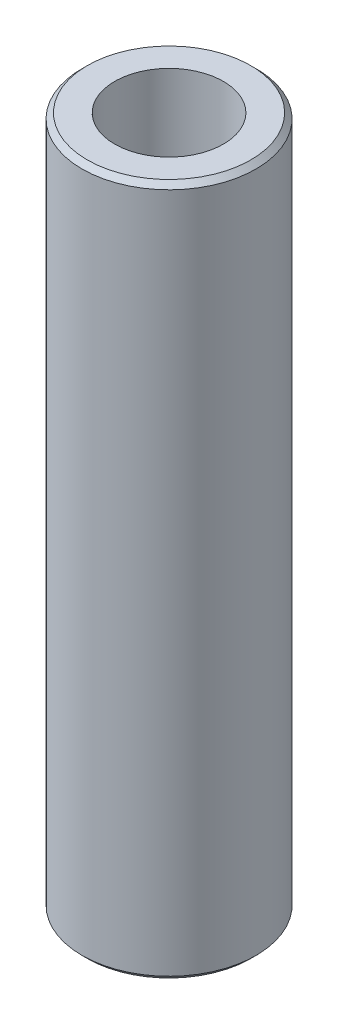
ISO-10303-21;
HEADER;
FILE_DESCRIPTION(('STEP AP214'),'2;1');
FILE_NAME('part.step','',(''),(''),'','','');
FILE_SCHEMA(('AUTOMOTIVE_DESIGN { 1 0 10303 214 1 1 1 1 }'));
ENDSEC;
DATA;
#1=APPLICATION_CONTEXT('core data for automotive mechanical design processes');
#2=APPLICATION_PROTOCOL_DEFINITION('international standard','automotive_design',2000,#1);
#3=PRODUCT_CONTEXT('',#1,'mechanical');
#4=PRODUCT('Part','Part','',(#3));
#5=PRODUCT_RELATED_PRODUCT_CATEGORY('part','',(#4));
#6=PRODUCT_DEFINITION_FORMATION('','',#4);
#7=PRODUCT_DEFINITION_CONTEXT('part definition',#1,'design');
#8=PRODUCT_DEFINITION('design','',#6,#7);
#9=PRODUCT_DEFINITION_SHAPE('','',#8);
#10=(LENGTH_UNIT() NAMED_UNIT(*) SI_UNIT(.MILLI.,.METRE.));
#11=(NAMED_UNIT(*) PLANE_ANGLE_UNIT() SI_UNIT($,.RADIAN.));
#12=(NAMED_UNIT(*) SI_UNIT($,.STERADIAN.) SOLID_ANGLE_UNIT());
#13=UNCERTAINTY_MEASURE_WITH_UNIT(LENGTH_MEASURE(1.E-05),#10,'distance_accuracy_value','');
#14=(GEOMETRIC_REPRESENTATION_CONTEXT(3) GLOBAL_UNCERTAINTY_ASSIGNED_CONTEXT((#13)) GLOBAL_UNIT_ASSIGNED_CONTEXT((#10,
#11,#12)) REPRESENTATION_CONTEXT('',''));
#15=CARTESIAN_POINT('',(0.,0.,0.));
#16=DIRECTION('',(0.,0.,1.));
#17=DIRECTION('',(1.,0.,0.));
#18=AXIS2_PLACEMENT_3D('',#15,#16,#17);
#19=CARTESIAN_POINT('',(0.,278.230469036696,0.));
#20=DIRECTION('',(0.,-1.,0.));
#21=DIRECTION('',(0.,0.,-1.));
#22=AXIS2_PLACEMENT_3D('',#19,#20,#21);
#23=CYLINDRICAL_SURFACE('',#22,35.);
#24=CARTESIAN_POINT('',(0.,276.122898551821,0.));
#25=DIRECTION('',(0.,1.,0.));
#26=DIRECTION('',(0.,0.,1.));
#27=AXIS2_PLACEMENT_3D('',#24,#25,#26);
#28=CIRCLE('',#27,35.);
#29=CARTESIAN_POINT('',(0.,276.122898551821,35.));
#30=VERTEX_POINT('',#29);
#31=EDGE_CURVE('E50',#30,#30,#28,.F.);
#32=ORIENTED_EDGE('',*,*,#31,.T.);
#33=EDGE_LOOP('',(#32));
#34=FACE_BOUND('',#33,.T.);
#35=CARTESIAN_POINT('',(0.,2.10757048487475,0.));
#36=DIRECTION('',(0.,1.,0.));
#37=DIRECTION('',(0.,0.,1.));
#38=AXIS2_PLACEMENT_3D('',#35,#36,#37);
#39=CIRCLE('',#38,35.);
#40=CARTESIAN_POINT('',(0.,2.10757048487475,35.));
#41=VERTEX_POINT('',#40);
#42=EDGE_CURVE('E51',#41,#41,#39,.T.);
#43=ORIENTED_EDGE('',*,*,#42,.T.);
#44=EDGE_LOOP('',(#43));
#45=FACE_BOUND('',#44,.T.);
#46=ADVANCED_FACE('F39',(#34,#45),#23,.T.);
#47=CARTESIAN_POINT('',(0.,278.230469036696,0.));
#48=DIRECTION('',(0.,1.,0.));
#49=DIRECTION('',(0.,0.,1.));
#50=AXIS2_PLACEMENT_3D('',#47,#48,#49);
#51=PLANE('',#50);
#52=CARTESIAN_POINT('',(0.,278.230469036696,0.));
#53=DIRECTION('',(0.,1.,0.));
#54=DIRECTION('',(0.,0.,1.));
#55=AXIS2_PLACEMENT_3D('',#52,#53,#54);
#56=CIRCLE('',#55,32.8924295151252);
#57=CARTESIAN_POINT('',(0.,278.230469036696,32.8924295151252));
#58=VERTEX_POINT('',#57);
#59=EDGE_CURVE('E54',#58,#58,#56,.T.);
#60=ORIENTED_EDGE('',*,*,#59,.T.);
#61=EDGE_LOOP('',(#60));
#62=FACE_BOUND('',#61,.T.);
#63=CARTESIAN_POINT('',(0.,278.230469036696,0.));
#64=DIRECTION('',(0.,1.,0.));
#65=DIRECTION('',(0.,0.,1.));
#66=AXIS2_PLACEMENT_3D('',#63,#64,#65);
#67=CIRCLE('',#66,21.8760022699073);
#68=CARTESIAN_POINT('',(0.,278.230469036696,21.8760022699073));
#69=VERTEX_POINT('',#68);
#70=EDGE_CURVE('E58',#69,#69,#67,.T.);
#71=ORIENTED_EDGE('',*,*,#70,.F.);
#72=EDGE_LOOP('',(#71));
#73=FACE_BOUND('',#72,.T.);
#74=ADVANCED_FACE('F69',(#62,#73),#51,.T.);
#75=CARTESIAN_POINT('',(0.,0.,0.));
#76=DIRECTION('',(0.,1.,0.));
#77=DIRECTION('',(0.,0.,1.));
#78=AXIS2_PLACEMENT_3D('',#75,#76,#77);
#79=PLANE('',#78);
#80=CARTESIAN_POINT('',(0.,0.,0.));
#81=DIRECTION('',(0.,1.,0.));
#82=DIRECTION('',(0.,0.,1.));
#83=AXIS2_PLACEMENT_3D('',#80,#81,#82);
#84=CIRCLE('',#83,32.8924295151252);
#85=CARTESIAN_POINT('',(0.,0.,32.8924295151252));
#86=VERTEX_POINT('',#85);
#87=EDGE_CURVE('E10',#86,#86,#84,.F.);
#88=ORIENTED_EDGE('',*,*,#87,.T.);
#89=EDGE_LOOP('',(#88));
#90=FACE_BOUND('',#89,.T.);
#91=CARTESIAN_POINT('',(0.,0.,0.));
#92=DIRECTION('',(0.,1.,0.));
#93=DIRECTION('',(0.,0.,1.));
#94=AXIS2_PLACEMENT_3D('',#91,#92,#93);
#95=CIRCLE('',#94,21.8760022699073);
#96=CARTESIAN_POINT('',(0.,0.,21.8760022699073));
#97=VERTEX_POINT('',#96);
#98=EDGE_CURVE('E63',#97,#97,#95,.T.);
#99=ORIENTED_EDGE('',*,*,#98,.T.);
#100=EDGE_LOOP('',(#99));
#101=FACE_BOUND('',#100,.T.);
#102=ADVANCED_FACE('F75',(#90,#101),#79,.F.);
#103=CARTESIAN_POINT('',(0.,278.230469036696,0.));
#104=DIRECTION('',(0.,-1.,0.));
#105=DIRECTION('',(0.,0.,-1.));
#106=AXIS2_PLACEMENT_3D('',#103,#104,#105);
#107=CYLINDRICAL_SURFACE('',#106,21.8760022699073);
#108=ORIENTED_EDGE('',*,*,#70,.T.);
#109=EDGE_LOOP('',(#108));
#110=FACE_BOUND('',#109,.T.);
#111=ORIENTED_EDGE('',*,*,#98,.F.);
#112=EDGE_LOOP('',(#111));
#113=FACE_BOUND('',#112,.T.);
#114=ADVANCED_FACE('F70',(#110,#113),#107,.F.);
#115=CARTESIAN_POINT('',(0.,278.230469036696,0.));
#116=DIRECTION('',(0.,-1.,0.));
#117=DIRECTION('',(0.,0.,-1.));
#118=AXIS2_PLACEMENT_3D('',#115,#116,#117);
#119=CONICAL_SURFACE('',#118,32.8924295151252,0.78539816339745);
#120=ORIENTED_EDGE('',*,*,#31,.F.);
#121=EDGE_LOOP('',(#120));
#122=FACE_BOUND('',#121,.T.);
#123=ORIENTED_EDGE('',*,*,#59,.F.);
#124=EDGE_LOOP('',(#123));
#125=FACE_BOUND('',#124,.T.);
#126=ADVANCED_FACE('F81',(#122,#125),#119,.T.);
#127=CARTESIAN_POINT('',(0.,2.10757048487475,0.));
#128=DIRECTION('',(0.,1.,0.));
#129=DIRECTION('',(0.,0.,1.));
#130=AXIS2_PLACEMENT_3D('',#127,#128,#129);
#131=CONICAL_SURFACE('',#130,35.,0.785398163397457);
#132=ORIENTED_EDGE('',*,*,#87,.F.);
#133=EDGE_LOOP('',(#132));
#134=FACE_BOUND('',#133,.T.);
#135=ORIENTED_EDGE('',*,*,#42,.F.);
#136=EDGE_LOOP('',(#135));
#137=FACE_BOUND('',#136,.T.);
#138=ADVANCED_FACE('F45',(#134,#137),#131,.T.);
#139=CLOSED_SHELL('',(#46,#74,#102,#114,#126,#138));
#140=MANIFOLD_SOLID_BREP('B2',#139);
#141=ADVANCED_BREP_SHAPE_REPRESENTATION('',(#18,#140),#14);
#142=SHAPE_DEFINITION_REPRESENTATION(#9,#141);
ENDSEC;
END-ISO-10303-21;
